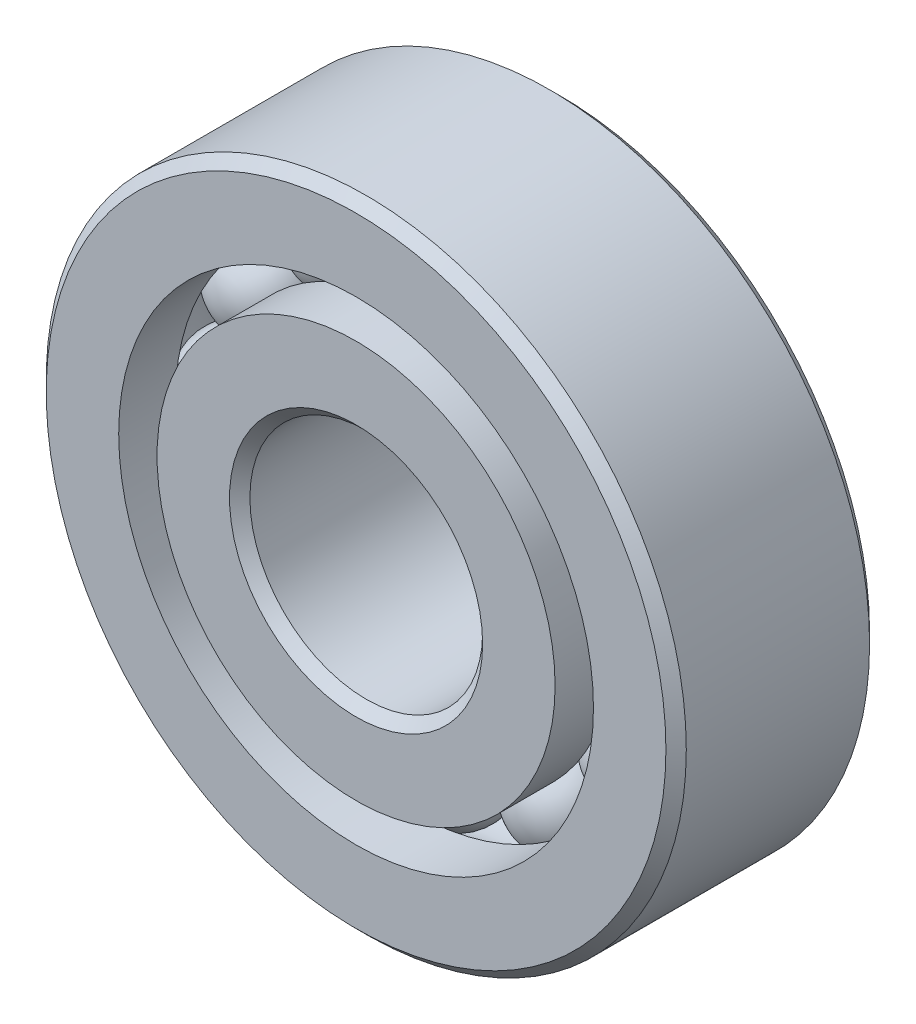
ISO-10303-21;
HEADER;
FILE_DESCRIPTION(('STEP AP214'),'2;1');
FILE_NAME('part.step','',(''),(''),'','','');
FILE_SCHEMA(('AUTOMOTIVE_DESIGN { 1 0 10303 214 1 1 1 1 }'));
ENDSEC;
DATA;
#1=APPLICATION_CONTEXT('core data for automotive mechanical design processes');
#2=APPLICATION_PROTOCOL_DEFINITION('international standard','automotive_design',2000,#1);
#3=PRODUCT_CONTEXT('',#1,'mechanical');
#4=PRODUCT('Part','Part','',(#3));
#5=PRODUCT_RELATED_PRODUCT_CATEGORY('part','',(#4));
#6=PRODUCT_DEFINITION_FORMATION('','',#4);
#7=PRODUCT_DEFINITION_CONTEXT('part definition',#1,'design');
#8=PRODUCT_DEFINITION('design','',#6,#7);
#9=PRODUCT_DEFINITION_SHAPE('','',#8);
#10=(LENGTH_UNIT() NAMED_UNIT(*) SI_UNIT(.MILLI.,.METRE.));
#11=(NAMED_UNIT(*) PLANE_ANGLE_UNIT() SI_UNIT($,.RADIAN.));
#12=(NAMED_UNIT(*) SI_UNIT($,.STERADIAN.) SOLID_ANGLE_UNIT());
#13=UNCERTAINTY_MEASURE_WITH_UNIT(LENGTH_MEASURE(1.E-05),#10,'distance_accuracy_value','');
#14=(GEOMETRIC_REPRESENTATION_CONTEXT(3) GLOBAL_UNCERTAINTY_ASSIGNED_CONTEXT((#13)) GLOBAL_UNIT_ASSIGNED_CONTEXT((#10,
#11,#12)) REPRESENTATION_CONTEXT('',''));
#15=CARTESIAN_POINT('',(0.,0.,0.));
#16=DIRECTION('',(0.,0.,1.));
#17=DIRECTION('',(1.,0.,0.));
#18=AXIS2_PLACEMENT_3D('',#15,#16,#17);
#19=CARTESIAN_POINT('',(-3.74999999999992,6.49519052838334,0.));
#20=DIRECTION('',(0.,0.,1.));
#21=DIRECTION('',(-0.499999999999989,0.866025403784445,0.));
#22=AXIS2_PLACEMENT_3D('',#19,#20,#21);
#23=SPHERICAL_SURFACE('',#22,1.68952158656808);
#24=CARTESIAN_POINT('',(-3.74999999999992,6.49519052838334,1.68952158656808));
#25=VERTEX_POINT('',#24);
#26=VERTEX_LOOP('',#25);
#27=FACE_BOUND('',#26,.T.);
#28=ADVANCED_FACE('F42',(#27),#23,.T.);
#29=CLOSED_SHELL('',(#28));
#30=MANIFOLD_SOLID_BREP('B2',#29);
#31=CARTESIAN_POINT('',(-6.49519052838325,3.75000000000008,0.));
#32=DIRECTION('',(0.,0.,1.));
#33=DIRECTION('',(-0.866025403784433,0.50000000000001,0.));
#34=AXIS2_PLACEMENT_3D('',#31,#32,#33);
#35=SPHERICAL_SURFACE('',#34,1.68952158656808);
#36=CARTESIAN_POINT('',(-6.49519052838325,3.75000000000008,1.68952158656808));
#37=VERTEX_POINT('',#36);
#38=VERTEX_LOOP('',#37);
#39=FACE_BOUND('',#38,.T.);
#40=ADVANCED_FACE('F63',(#39),#35,.T.);
#41=CLOSED_SHELL('',(#40));
#42=MANIFOLD_SOLID_BREP('B6',#41);
#43=CARTESIAN_POINT('',(-7.5,0.,0.));
#44=DIRECTION('',(0.,0.,1.));
#45=DIRECTION('',(-1.,0.,0.));
#46=AXIS2_PLACEMENT_3D('',#43,#44,#45);
#47=SPHERICAL_SURFACE('',#46,1.68952158656808);
#48=CARTESIAN_POINT('',(-7.5,0.,1.68952158656808));
#49=VERTEX_POINT('',#48);
#50=VERTEX_LOOP('',#49);
#51=FACE_BOUND('',#50,.T.);
#52=ADVANCED_FACE('F84',(#51),#47,.T.);
#53=CLOSED_SHELL('',(#52));
#54=MANIFOLD_SOLID_BREP('B38',#53);
#55=CARTESIAN_POINT('',(-6.49519052838332,-3.74999999999994,0.));
#56=DIRECTION('',(0.,0.,1.));
#57=DIRECTION('',(-0.866025403784443,-0.499999999999992,0.));
#58=AXIS2_PLACEMENT_3D('',#55,#56,#57);
#59=SPHERICAL_SURFACE('',#58,1.68952158656808);
#60=CARTESIAN_POINT('',(-6.49519052838332,-3.74999999999994,1.68952158656808));
#61=VERTEX_POINT('',#60);
#62=VERTEX_LOOP('',#61);
#63=FACE_BOUND('',#62,.T.);
#64=ADVANCED_FACE('F105',(#63),#59,.T.);
#65=CLOSED_SHELL('',(#64));
#66=MANIFOLD_SOLID_BREP('B59',#65);
#67=CARTESIAN_POINT('',(-3.75000000000005,-6.49519052838326,0.));
#68=DIRECTION('',(0.,0.,1.));
#69=DIRECTION('',(-0.500000000000007,-0.866025403784435,0.));
#70=AXIS2_PLACEMENT_3D('',#67,#68,#69);
#71=SPHERICAL_SURFACE('',#70,1.68952158656808);
#72=CARTESIAN_POINT('',(-3.75000000000005,-6.49519052838326,1.68952158656808));
#73=VERTEX_POINT('',#72);
#74=VERTEX_LOOP('',#73);
#75=FACE_BOUND('',#74,.T.);
#76=ADVANCED_FACE('F126',(#75),#71,.T.);
#77=CLOSED_SHELL('',(#76));
#78=MANIFOLD_SOLID_BREP('B80',#77);
#79=CARTESIAN_POINT('',(0.,-7.5,0.));
#80=DIRECTION('',(0.,0.,1.));
#81=DIRECTION('',(0.,-1.,0.));
#82=AXIS2_PLACEMENT_3D('',#79,#80,#81);
#83=SPHERICAL_SURFACE('',#82,1.68952158656808);
#84=CARTESIAN_POINT('',(0.,-7.5,1.68952158656808));
#85=VERTEX_POINT('',#84);
#86=VERTEX_LOOP('',#85);
#87=FACE_BOUND('',#86,.T.);
#88=ADVANCED_FACE('F147',(#87),#83,.T.);
#89=CLOSED_SHELL('',(#88));
#90=MANIFOLD_SOLID_BREP('B101',#89);
#91=CARTESIAN_POINT('',(3.74999999999996,-6.49519052838331,0.));
#92=DIRECTION('',(0.,0.,1.));
#93=DIRECTION('',(0.499999999999995,-0.866025403784442,0.));
#94=AXIS2_PLACEMENT_3D('',#91,#92,#93);
#95=SPHERICAL_SURFACE('',#94,1.68952158656808);
#96=CARTESIAN_POINT('',(3.74999999999996,-6.49519052838331,1.68952158656808));
#97=VERTEX_POINT('',#96);
#98=VERTEX_LOOP('',#97);
#99=FACE_BOUND('',#98,.T.);
#100=ADVANCED_FACE('F168',(#99),#95,.T.);
#101=CLOSED_SHELL('',(#100));
#102=MANIFOLD_SOLID_BREP('B122',#101);
#103=CARTESIAN_POINT('',(6.49519052838327,-3.75000000000003,0.));
#104=DIRECTION('',(0.,0.,1.));
#105=DIRECTION('',(0.866025403784436,-0.500000000000004,0.));
#106=AXIS2_PLACEMENT_3D('',#103,#104,#105);
#107=SPHERICAL_SURFACE('',#106,1.68952158656808);
#108=CARTESIAN_POINT('',(6.49519052838327,-3.75000000000003,1.68952158656808));
#109=VERTEX_POINT('',#108);
#110=VERTEX_LOOP('',#109);
#111=FACE_BOUND('',#110,.T.);
#112=ADVANCED_FACE('F189',(#111),#107,.T.);
#113=CLOSED_SHELL('',(#112));
#114=MANIFOLD_SOLID_BREP('B143',#113);
#115=CARTESIAN_POINT('',(7.5,0.,0.));
#116=DIRECTION('',(0.,0.,1.));
#117=DIRECTION('',(1.,0.,0.));
#118=AXIS2_PLACEMENT_3D('',#115,#116,#117);
#119=SPHERICAL_SURFACE('',#118,1.68952158656808);
#120=CARTESIAN_POINT('',(7.5,0.,1.68952158656808));
#121=VERTEX_POINT('',#120);
#122=VERTEX_LOOP('',#121);
#123=FACE_BOUND('',#122,.T.);
#124=ADVANCED_FACE('F210',(#123),#119,.T.);
#125=CLOSED_SHELL('',(#124));
#126=MANIFOLD_SOLID_BREP('B164',#125);
#127=CARTESIAN_POINT('',(6.4951905283833,3.74999999999998,0.));
#128=DIRECTION('',(0.,0.,1.));
#129=DIRECTION('',(0.86602540378444,0.499999999999998,0.));
#130=AXIS2_PLACEMENT_3D('',#127,#128,#129);
#131=SPHERICAL_SURFACE('',#130,1.68952158656808);
#132=CARTESIAN_POINT('',(6.4951905283833,3.74999999999998,1.68952158656808));
#133=VERTEX_POINT('',#132);
#134=VERTEX_LOOP('',#133);
#135=FACE_BOUND('',#134,.T.);
#136=ADVANCED_FACE('F231',(#135),#131,.T.);
#137=CLOSED_SHELL('',(#136));
#138=MANIFOLD_SOLID_BREP('B185',#137);
#139=CARTESIAN_POINT('',(3.75000000000001,6.49519052838328,0.));
#140=DIRECTION('',(0.,0.,1.));
#141=DIRECTION('',(0.500000000000001,0.866025403784438,0.));
#142=AXIS2_PLACEMENT_3D('',#139,#140,#141);
#143=SPHERICAL_SURFACE('',#142,1.68952158656808);
#144=CARTESIAN_POINT('',(3.75000000000001,6.49519052838328,1.68952158656808));
#145=VERTEX_POINT('',#144);
#146=VERTEX_LOOP('',#145);
#147=FACE_BOUND('',#146,.T.);
#148=ADVANCED_FACE('F252',(#147),#143,.T.);
#149=CLOSED_SHELL('',(#148));
#150=MANIFOLD_SOLID_BREP('B206',#149);
#151=CARTESIAN_POINT('',(0.,7.5,0.));
#152=DIRECTION('',(0.,0.,1.));
#153=DIRECTION('',(0.,1.,0.));
#154=AXIS2_PLACEMENT_3D('',#151,#152,#153);
#155=SPHERICAL_SURFACE('',#154,1.68952158656808);
#156=CARTESIAN_POINT('',(0.,7.5,1.68952158656808));
#157=VERTEX_POINT('',#156);
#158=VERTEX_LOOP('',#157);
#159=FACE_BOUND('',#158,.T.);
#160=ADVANCED_FACE('F275',(#159),#155,.T.);
#161=CLOSED_SHELL('',(#160));
#162=MANIFOLD_SOLID_BREP('B227',#161);
#163=CARTESIAN_POINT('',(0.,6.84065934065934,3.5));
#164=DIRECTION('',(0.,0.,-1.));
#165=DIRECTION('',(-1.,0.,0.));
#166=AXIS2_PLACEMENT_3D('',#163,#164,#165);
#167=PLANE('',#166);
#168=CARTESIAN_POINT('',(0.,0.,3.5));
#169=DIRECTION('',(0.,0.,1.));
#170=DIRECTION('',(1.,0.,0.));
#171=AXIS2_PLACEMENT_3D('',#168,#169,#170);
#172=CIRCLE('',#171,4.35);
#173=CARTESIAN_POINT('',(4.35,0.,3.5));
#174=VERTEX_POINT('',#173);
#175=EDGE_CURVE('E323',#174,#174,#172,.T.);
#176=ORIENTED_EDGE('',*,*,#175,.F.);
#177=EDGE_LOOP('',(#176));
#178=FACE_BOUND('',#177,.T.);
#179=CARTESIAN_POINT('',(0.,0.,3.5));
#180=DIRECTION('',(0.,0.,1.));
#181=DIRECTION('',(1.,0.,0.));
#182=AXIS2_PLACEMENT_3D('',#179,#180,#181);
#183=CIRCLE('',#182,6.84065934065934);
#184=CARTESIAN_POINT('',(6.84065934065934,0.,3.5));
#185=VERTEX_POINT('',#184);
#186=EDGE_CURVE('E274',#185,#185,#183,.T.);
#187=ORIENTED_EDGE('',*,*,#186,.T.);
#188=EDGE_LOOP('',(#187));
#189=FACE_BOUND('',#188,.T.);
#190=ADVANCED_FACE('F295',(#178,#189),#167,.F.);
#191=CARTESIAN_POINT('',(0.,0.,3.5));
#192=DIRECTION('',(0.,0.,1.));
#193=DIRECTION('',(1.,0.,0.));
#194=AXIS2_PLACEMENT_3D('',#191,#192,#193);
#195=CYLINDRICAL_SURFACE('',#194,6.84065934065934);
#196=ORIENTED_EDGE('',*,*,#186,.F.);
#197=EDGE_LOOP('',(#196));
#198=FACE_BOUND('',#197,.T.);
#199=CARTESIAN_POINT('',(0.,0.,1.55555555555556));
#200=DIRECTION('',(0.,0.,1.));
#201=DIRECTION('',(1.,0.,0.));
#202=AXIS2_PLACEMENT_3D('',#199,#200,#201);
#203=CIRCLE('',#202,6.84065934065934);
#204=CARTESIAN_POINT('',(6.84065934065934,0.,1.55555555555556));
#205=VERTEX_POINT('',#204);
#206=EDGE_CURVE('E301',#205,#205,#203,.T.);
#207=ORIENTED_EDGE('',*,*,#206,.T.);
#208=EDGE_LOOP('',(#207));
#209=FACE_BOUND('',#208,.T.);
#210=ADVANCED_FACE('F330',(#198,#209),#195,.T.);
#211=CARTESIAN_POINT('',(0.,0.,0.));
#212=DIRECTION('',(0.,0.,1.));
#213=DIRECTION('',(1.,0.,0.));
#214=AXIS2_PLACEMENT_3D('',#211,#212,#213);
#215=TOROIDAL_SURFACE('',#214,7.5,1.68952158656808);
#216=ORIENTED_EDGE('',*,*,#206,.F.);
#217=EDGE_LOOP('',(#216));
#218=FACE_BOUND('',#217,.T.);
#219=CARTESIAN_POINT('',(0.,0.,-1.55555555555556));
#220=DIRECTION('',(0.,0.,1.));
#221=DIRECTION('',(1.,0.,0.));
#222=AXIS2_PLACEMENT_3D('',#219,#220,#221);
#223=CIRCLE('',#222,6.84065934065934);
#224=CARTESIAN_POINT('',(6.84065934065934,0.,-1.55555555555556));
#225=VERTEX_POINT('',#224);
#226=EDGE_CURVE('E305',#225,#225,#223,.T.);
#227=ORIENTED_EDGE('',*,*,#226,.T.);
#228=EDGE_LOOP('',(#227));
#229=FACE_BOUND('',#228,.T.);
#230=ADVANCED_FACE('F334',(#218,#229),#215,.F.);
#231=CARTESIAN_POINT('',(0.,0.,3.5));
#232=DIRECTION('',(0.,0.,1.));
#233=DIRECTION('',(1.,0.,0.));
#234=AXIS2_PLACEMENT_3D('',#231,#232,#233);
#235=CYLINDRICAL_SURFACE('',#234,6.84065934065934);
#236=ORIENTED_EDGE('',*,*,#226,.F.);
#237=EDGE_LOOP('',(#236));
#238=FACE_BOUND('',#237,.T.);
#239=CARTESIAN_POINT('',(0.,0.,-3.5));
#240=DIRECTION('',(0.,0.,1.));
#241=DIRECTION('',(1.,0.,0.));
#242=AXIS2_PLACEMENT_3D('',#239,#240,#241);
#243=CIRCLE('',#242,6.84065934065934);
#244=CARTESIAN_POINT('',(6.84065934065934,0.,-3.5));
#245=VERTEX_POINT('',#244);
#246=EDGE_CURVE('E309',#245,#245,#243,.T.);
#247=ORIENTED_EDGE('',*,*,#246,.T.);
#248=EDGE_LOOP('',(#247));
#249=FACE_BOUND('',#248,.T.);
#250=ADVANCED_FACE('F339',(#238,#249),#235,.T.);
#251=CARTESIAN_POINT('',(0.,4.35,-3.5));
#252=DIRECTION('',(0.,0.,1.));
#253=DIRECTION('',(1.,0.,0.));
#254=AXIS2_PLACEMENT_3D('',#251,#252,#253);
#255=PLANE('',#254);
#256=ORIENTED_EDGE('',*,*,#246,.F.);
#257=EDGE_LOOP('',(#256));
#258=FACE_BOUND('',#257,.T.);
#259=CARTESIAN_POINT('',(0.,0.,-3.5));
#260=DIRECTION('',(0.,0.,1.));
#261=DIRECTION('',(1.,0.,0.));
#262=AXIS2_PLACEMENT_3D('',#259,#260,#261);
#263=CIRCLE('',#262,4.35);
#264=CARTESIAN_POINT('',(4.35,0.,-3.5));
#265=VERTEX_POINT('',#264);
#266=EDGE_CURVE('E314',#265,#265,#263,.T.);
#267=ORIENTED_EDGE('',*,*,#266,.T.);
#268=EDGE_LOOP('',(#267));
#269=FACE_BOUND('',#268,.T.);
#270=ADVANCED_FACE('F345',(#258,#269),#255,.F.);
#271=CARTESIAN_POINT('',(0.,0.,-3.15));
#272=DIRECTION('',(0.,0.,-1.));
#273=DIRECTION('',(-1.,0.,0.));
#274=AXIS2_PLACEMENT_3D('',#271,#272,#273);
#275=CONICAL_SURFACE('',#274,4.,0.785398163397446);
#276=ORIENTED_EDGE('',*,*,#266,.F.);
#277=EDGE_LOOP('',(#276));
#278=FACE_BOUND('',#277,.T.);
#279=CARTESIAN_POINT('',(0.,0.,-3.15));
#280=DIRECTION('',(0.,0.,1.));
#281=DIRECTION('',(1.,0.,0.));
#282=AXIS2_PLACEMENT_3D('',#279,#280,#281);
#283=CIRCLE('',#282,4.);
#284=CARTESIAN_POINT('',(4.,0.,-3.15));
#285=VERTEX_POINT('',#284);
#286=EDGE_CURVE('E317',#285,#285,#283,.T.);
#287=ORIENTED_EDGE('',*,*,#286,.T.);
#288=EDGE_LOOP('',(#287));
#289=FACE_BOUND('',#288,.T.);
#290=ADVANCED_FACE('F349',(#278,#289),#275,.F.);
#291=CARTESIAN_POINT('',(0.,0.,3.5));
#292=DIRECTION('',(0.,0.,1.));
#293=DIRECTION('',(1.,0.,0.));
#294=AXIS2_PLACEMENT_3D('',#291,#292,#293);
#295=CYLINDRICAL_SURFACE('',#294,4.);
#296=ORIENTED_EDGE('',*,*,#286,.F.);
#297=EDGE_LOOP('',(#296));
#298=FACE_BOUND('',#297,.T.);
#299=CARTESIAN_POINT('',(0.,0.,3.15));
#300=DIRECTION('',(0.,0.,1.));
#301=DIRECTION('',(1.,0.,0.));
#302=AXIS2_PLACEMENT_3D('',#299,#300,#301);
#303=CIRCLE('',#302,4.);
#304=CARTESIAN_POINT('',(4.,0.,3.15));
#305=VERTEX_POINT('',#304);
#306=EDGE_CURVE('E320',#305,#305,#303,.T.);
#307=ORIENTED_EDGE('',*,*,#306,.T.);
#308=EDGE_LOOP('',(#307));
#309=FACE_BOUND('',#308,.T.);
#310=ADVANCED_FACE('F353',(#298,#309),#295,.F.);
#311=CARTESIAN_POINT('',(0.,0.,3.5));
#312=DIRECTION('',(0.,0.,1.));
#313=DIRECTION('',(1.,0.,0.));
#314=AXIS2_PLACEMENT_3D('',#311,#312,#313);
#315=CONICAL_SURFACE('',#314,4.35,0.785398163397449);
#316=ORIENTED_EDGE('',*,*,#306,.F.);
#317=EDGE_LOOP('',(#316));
#318=FACE_BOUND('',#317,.T.);
#319=ORIENTED_EDGE('',*,*,#175,.T.);
#320=EDGE_LOOP('',(#319));
#321=FACE_BOUND('',#320,.T.);
#322=ADVANCED_FACE('F327',(#318,#321),#315,.F.);
#323=CLOSED_SHELL('',(#190,#210,#230,#250,#270,#290,#310,#322));
#324=MANIFOLD_SOLID_BREP('B248',#323);
#325=CARTESIAN_POINT('',(0.,0.,3.15));
#326=DIRECTION('',(0.,0.,-1.));
#327=DIRECTION('',(-1.,0.,0.));
#328=AXIS2_PLACEMENT_3D('',#325,#326,#327);
#329=CONICAL_SURFACE('',#328,11.,0.785398163397448);
#330=CARTESIAN_POINT('',(0.,0.,3.5));
#331=DIRECTION('',(0.,0.,1.));
#332=DIRECTION('',(1.,0.,0.));
#333=AXIS2_PLACEMENT_3D('',#330,#331,#332);
#334=CIRCLE('',#333,10.65);
#335=CARTESIAN_POINT('',(10.65,0.,3.5));
#336=VERTEX_POINT('',#335);
#337=EDGE_CURVE('E445',#336,#336,#334,.T.);
#338=ORIENTED_EDGE('',*,*,#337,.F.);
#339=EDGE_LOOP('',(#338));
#340=FACE_BOUND('',#339,.T.);
#341=CARTESIAN_POINT('',(0.,0.,3.15));
#342=DIRECTION('',(0.,0.,1.));
#343=DIRECTION('',(1.,0.,0.));
#344=AXIS2_PLACEMENT_3D('',#341,#342,#343);
#345=CIRCLE('',#344,11.);
#346=CARTESIAN_POINT('',(11.,0.,3.15));
#347=VERTEX_POINT('',#346);
#348=EDGE_CURVE('E294',#347,#347,#345,.T.);
#349=ORIENTED_EDGE('',*,*,#348,.T.);
#350=EDGE_LOOP('',(#349));
#351=FACE_BOUND('',#350,.T.);
#352=ADVANCED_FACE('F417',(#340,#351),#329,.T.);
#353=CARTESIAN_POINT('',(0.,0.,3.5));
#354=DIRECTION('',(0.,0.,1.));
#355=DIRECTION('',(1.,0.,0.));
#356=AXIS2_PLACEMENT_3D('',#353,#354,#355);
#357=CYLINDRICAL_SURFACE('',#356,11.);
#358=ORIENTED_EDGE('',*,*,#348,.F.);
#359=EDGE_LOOP('',(#358));
#360=FACE_BOUND('',#359,.T.);
#361=CARTESIAN_POINT('',(0.,0.,-3.15));
#362=DIRECTION('',(0.,0.,1.));
#363=DIRECTION('',(1.,0.,0.));
#364=AXIS2_PLACEMENT_3D('',#361,#362,#363);
#365=CIRCLE('',#364,11.);
#366=CARTESIAN_POINT('',(11.,0.,-3.15));
#367=VERTEX_POINT('',#366);
#368=EDGE_CURVE('E423',#367,#367,#365,.T.);
#369=ORIENTED_EDGE('',*,*,#368,.T.);
#370=EDGE_LOOP('',(#369));
#371=FACE_BOUND('',#370,.T.);
#372=ADVANCED_FACE('F452',(#360,#371),#357,.T.);
#373=CARTESIAN_POINT('',(0.,0.,-3.5));
#374=DIRECTION('',(0.,0.,1.));
#375=DIRECTION('',(1.,0.,0.));
#376=AXIS2_PLACEMENT_3D('',#373,#374,#375);
#377=CONICAL_SURFACE('',#376,10.65,0.785398163397447);
#378=ORIENTED_EDGE('',*,*,#368,.F.);
#379=EDGE_LOOP('',(#378));
#380=FACE_BOUND('',#379,.T.);
#381=CARTESIAN_POINT('',(0.,0.,-3.5));
#382=DIRECTION('',(0.,0.,1.));
#383=DIRECTION('',(1.,0.,0.));
#384=AXIS2_PLACEMENT_3D('',#381,#382,#383);
#385=CIRCLE('',#384,10.65);
#386=CARTESIAN_POINT('',(10.65,0.,-3.5));
#387=VERTEX_POINT('',#386);
#388=EDGE_CURVE('E427',#387,#387,#385,.T.);
#389=ORIENTED_EDGE('',*,*,#388,.T.);
#390=EDGE_LOOP('',(#389));
#391=FACE_BOUND('',#390,.T.);
#392=ADVANCED_FACE('F456',(#380,#391),#377,.T.);
#393=CARTESIAN_POINT('',(0.,10.65,-3.5));
#394=DIRECTION('',(0.,0.,1.));
#395=DIRECTION('',(1.,0.,0.));
#396=AXIS2_PLACEMENT_3D('',#393,#394,#395);
#397=PLANE('',#396);
#398=ORIENTED_EDGE('',*,*,#388,.F.);
#399=EDGE_LOOP('',(#398));
#400=FACE_BOUND('',#399,.T.);
#401=CARTESIAN_POINT('',(0.,0.,-3.5));
#402=DIRECTION('',(0.,0.,1.));
#403=DIRECTION('',(1.,0.,0.));
#404=AXIS2_PLACEMENT_3D('',#401,#402,#403);
#405=CIRCLE('',#404,8.15934065934066);
#406=CARTESIAN_POINT('',(8.15934065934066,0.,-3.5));
#407=VERTEX_POINT('',#406);
#408=EDGE_CURVE('E431',#407,#407,#405,.T.);
#409=ORIENTED_EDGE('',*,*,#408,.T.);
#410=EDGE_LOOP('',(#409));
#411=FACE_BOUND('',#410,.T.);
#412=ADVANCED_FACE('F461',(#400,#411),#397,.F.);
#413=CARTESIAN_POINT('',(0.,0.,3.5));
#414=DIRECTION('',(0.,0.,1.));
#415=DIRECTION('',(1.,0.,0.));
#416=AXIS2_PLACEMENT_3D('',#413,#414,#415);
#417=CYLINDRICAL_SURFACE('',#416,8.15934065934066);
#418=ORIENTED_EDGE('',*,*,#408,.F.);
#419=EDGE_LOOP('',(#418));
#420=FACE_BOUND('',#419,.T.);
#421=CARTESIAN_POINT('',(0.,0.,-1.55555555555556));
#422=DIRECTION('',(0.,0.,1.));
#423=DIRECTION('',(1.,0.,0.));
#424=AXIS2_PLACEMENT_3D('',#421,#422,#423);
#425=CIRCLE('',#424,8.15934065934066);
#426=CARTESIAN_POINT('',(8.15934065934066,0.,-1.55555555555556));
#427=VERTEX_POINT('',#426);
#428=EDGE_CURVE('E436',#427,#427,#425,.T.);
#429=ORIENTED_EDGE('',*,*,#428,.T.);
#430=EDGE_LOOP('',(#429));
#431=FACE_BOUND('',#430,.T.);
#432=ADVANCED_FACE('F467',(#420,#431),#417,.F.);
#433=CARTESIAN_POINT('',(0.,0.,0.));
#434=DIRECTION('',(0.,0.,1.));
#435=DIRECTION('',(1.,0.,0.));
#436=AXIS2_PLACEMENT_3D('',#433,#434,#435);
#437=TOROIDAL_SURFACE('',#436,7.5,1.68952158656808);
#438=ORIENTED_EDGE('',*,*,#428,.F.);
#439=EDGE_LOOP('',(#438));
#440=FACE_BOUND('',#439,.T.);
#441=CARTESIAN_POINT('',(0.,0.,1.55555555555555));
#442=DIRECTION('',(0.,0.,1.));
#443=DIRECTION('',(1.,0.,0.));
#444=AXIS2_PLACEMENT_3D('',#441,#442,#443);
#445=CIRCLE('',#444,8.15934065934066);
#446=CARTESIAN_POINT('',(8.15934065934066,0.,1.55555555555555));
#447=VERTEX_POINT('',#446);
#448=EDGE_CURVE('E439',#447,#447,#445,.T.);
#449=ORIENTED_EDGE('',*,*,#448,.T.);
#450=EDGE_LOOP('',(#449));
#451=FACE_BOUND('',#450,.T.);
#452=ADVANCED_FACE('F471',(#440,#451),#437,.F.);
#453=CARTESIAN_POINT('',(0.,0.,3.5));
#454=DIRECTION('',(0.,0.,1.));
#455=DIRECTION('',(1.,0.,0.));
#456=AXIS2_PLACEMENT_3D('',#453,#454,#455);
#457=CYLINDRICAL_SURFACE('',#456,8.15934065934066);
#458=ORIENTED_EDGE('',*,*,#448,.F.);
#459=EDGE_LOOP('',(#458));
#460=FACE_BOUND('',#459,.T.);
#461=CARTESIAN_POINT('',(0.,0.,3.5));
#462=DIRECTION('',(0.,0.,1.));
#463=DIRECTION('',(1.,0.,0.));
#464=AXIS2_PLACEMENT_3D('',#461,#462,#463);
#465=CIRCLE('',#464,8.15934065934066);
#466=CARTESIAN_POINT('',(8.15934065934066,0.,3.5));
#467=VERTEX_POINT('',#466);
#468=EDGE_CURVE('E442',#467,#467,#465,.T.);
#469=ORIENTED_EDGE('',*,*,#468,.T.);
#470=EDGE_LOOP('',(#469));
#471=FACE_BOUND('',#470,.T.);
#472=ADVANCED_FACE('F475',(#460,#471),#457,.F.);
#473=CARTESIAN_POINT('',(0.,10.65,3.5));
#474=DIRECTION('',(0.,0.,-1.));
#475=DIRECTION('',(-1.,0.,0.));
#476=AXIS2_PLACEMENT_3D('',#473,#474,#475);
#477=PLANE('',#476);
#478=ORIENTED_EDGE('',*,*,#468,.F.);
#479=EDGE_LOOP('',(#478));
#480=FACE_BOUND('',#479,.T.);
#481=ORIENTED_EDGE('',*,*,#337,.T.);
#482=EDGE_LOOP('',(#481));
#483=FACE_BOUND('',#482,.T.);
#484=ADVANCED_FACE('F449',(#480,#483),#477,.F.);
#485=CLOSED_SHELL('',(#352,#372,#392,#412,#432,#452,#472,#484));
#486=MANIFOLD_SOLID_BREP('B269',#485);
#487=ADVANCED_BREP_SHAPE_REPRESENTATION('',(#18,#30,#42,#54,#66,#78,#90,#102,#114,#126,#138,
#150,#162,#324,#486),#14);
#488=SHAPE_DEFINITION_REPRESENTATION(#9,#487);
ENDSEC;
END-ISO-10303-21;
